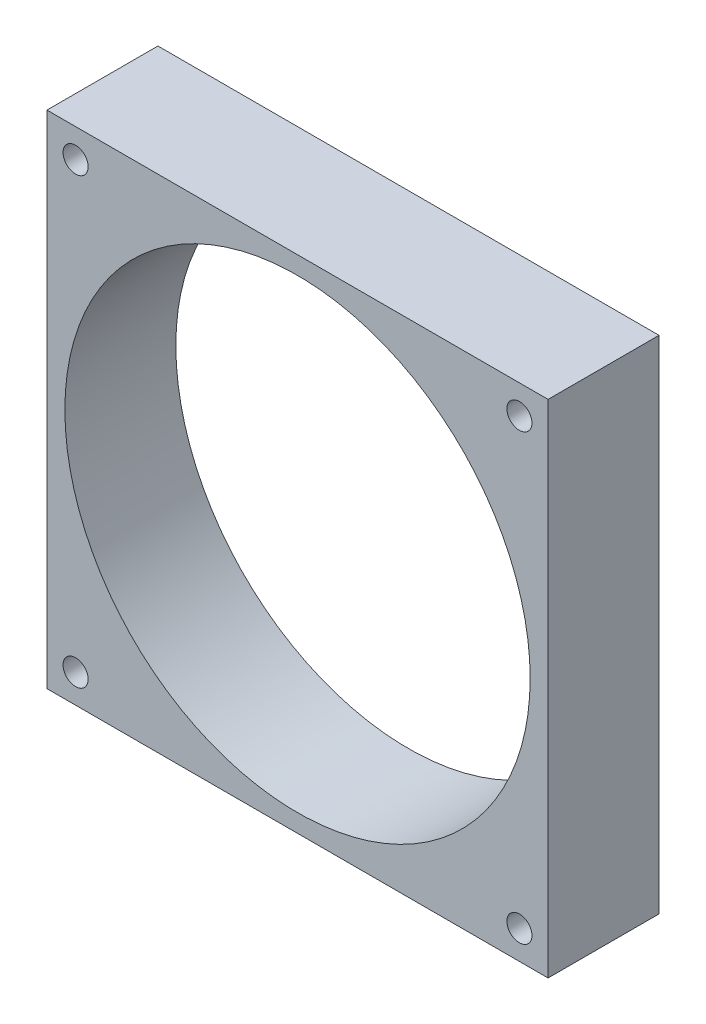
ISO-10303-21;
HEADER;
FILE_DESCRIPTION(('STEP AP214'),'2;1');
FILE_NAME('part.step','',(''),(''),'','','');
FILE_SCHEMA(('AUTOMOTIVE_DESIGN { 1 0 10303 214 1 1 1 1 }'));
ENDSEC;
DATA;
#1=APPLICATION_CONTEXT('core data for automotive mechanical design processes');
#2=APPLICATION_PROTOCOL_DEFINITION('international standard','automotive_design',2000,#1);
#3=PRODUCT_CONTEXT('',#1,'mechanical');
#4=PRODUCT('Part','Part','',(#3));
#5=PRODUCT_RELATED_PRODUCT_CATEGORY('part','',(#4));
#6=PRODUCT_DEFINITION_FORMATION('','',#4);
#7=PRODUCT_DEFINITION_CONTEXT('part definition',#1,'design');
#8=PRODUCT_DEFINITION('design','',#6,#7);
#9=PRODUCT_DEFINITION_SHAPE('','',#8);
#10=(LENGTH_UNIT() NAMED_UNIT(*) SI_UNIT(.MILLI.,.METRE.));
#11=(NAMED_UNIT(*) PLANE_ANGLE_UNIT() SI_UNIT($,.RADIAN.));
#12=(NAMED_UNIT(*) SI_UNIT($,.STERADIAN.) SOLID_ANGLE_UNIT());
#13=UNCERTAINTY_MEASURE_WITH_UNIT(LENGTH_MEASURE(1.E-05),#10,'distance_accuracy_value','');
#14=(GEOMETRIC_REPRESENTATION_CONTEXT(3) GLOBAL_UNCERTAINTY_ASSIGNED_CONTEXT((#13)) GLOBAL_UNIT_ASSIGNED_CONTEXT((#10,
#11,#12)) REPRESENTATION_CONTEXT('',''));
#15=CARTESIAN_POINT('',(0.,0.,0.));
#16=DIRECTION('',(0.,0.,1.));
#17=DIRECTION('',(1.,0.,0.));
#18=AXIS2_PLACEMENT_3D('',#15,#16,#17);
#19=CARTESIAN_POINT('',(35.,0.,15.5));
#20=DIRECTION('',(1.,0.,0.));
#21=DIRECTION('',(0.,1.,0.));
#22=AXIS2_PLACEMENT_3D('',#19,#20,#21);
#23=PLANE('',#22);
#24=DIRECTION('',(0.,-1.,0.));
#25=VECTOR('',#24,1.);
#26=CARTESIAN_POINT('',(35.,0.,0.));
#27=LINE('',#26,#25);
#28=CARTESIAN_POINT('',(35.,35.,0.));
#29=VERTEX_POINT('',#28);
#30=CARTESIAN_POINT('',(35.,-35.,0.));
#31=VERTEX_POINT('',#30);
#32=EDGE_CURVE('E117',#29,#31,#27,.T.);
#33=ORIENTED_EDGE('',*,*,#32,.F.);
#34=DIRECTION('',(0.,0.,-1.));
#35=VECTOR('',#34,1.);
#36=CARTESIAN_POINT('',(35.,35.,15.5));
#37=LINE('',#36,#35);
#38=CARTESIAN_POINT('',(35.,35.,15.5));
#39=VERTEX_POINT('',#38);
#40=EDGE_CURVE('E11',#39,#29,#37,.T.);
#41=ORIENTED_EDGE('',*,*,#40,.F.);
#42=DIRECTION('',(0.,-1.,0.));
#43=VECTOR('',#42,1.);
#44=CARTESIAN_POINT('',(35.,0.,15.5));
#45=LINE('',#44,#43);
#46=CARTESIAN_POINT('',(35.,-35.,15.5));
#47=VERTEX_POINT('',#46);
#48=EDGE_CURVE('E95',#39,#47,#45,.T.);
#49=ORIENTED_EDGE('',*,*,#48,.T.);
#50=DIRECTION('',(0.,0.,-1.));
#51=VECTOR('',#50,1.);
#52=CARTESIAN_POINT('',(35.,-35.,15.5));
#53=LINE('',#52,#51);
#54=EDGE_CURVE('E74',#47,#31,#53,.T.);
#55=ORIENTED_EDGE('',*,*,#54,.T.);
#56=EDGE_LOOP('',(#33,#41,#49,#55));
#57=FACE_BOUND('',#56,.T.);
#58=ADVANCED_FACE('F34',(#57),#23,.T.);
#59=CARTESIAN_POINT('',(0.,35.,15.5));
#60=DIRECTION('',(0.,1.,0.));
#61=DIRECTION('',(0.,0.,1.));
#62=AXIS2_PLACEMENT_3D('',#59,#60,#61);
#63=PLANE('',#62);
#64=DIRECTION('',(1.,0.,0.));
#65=VECTOR('',#64,1.);
#66=CARTESIAN_POINT('',(0.,35.,0.));
#67=LINE('',#66,#65);
#68=CARTESIAN_POINT('',(-35.,35.,0.));
#69=VERTEX_POINT('',#68);
#70=EDGE_CURVE('E86',#69,#29,#67,.T.);
#71=ORIENTED_EDGE('',*,*,#70,.F.);
#72=DIRECTION('',(0.,0.,-1.));
#73=VECTOR('',#72,1.);
#74=CARTESIAN_POINT('',(-35.,35.,15.5));
#75=LINE('',#74,#73);
#76=CARTESIAN_POINT('',(-35.,35.,15.5));
#77=VERTEX_POINT('',#76);
#78=EDGE_CURVE('E43',#77,#69,#75,.T.);
#79=ORIENTED_EDGE('',*,*,#78,.F.);
#80=DIRECTION('',(1.,0.,0.));
#81=VECTOR('',#80,1.);
#82=CARTESIAN_POINT('',(0.,35.,15.5));
#83=LINE('',#82,#81);
#84=EDGE_CURVE('E84',#77,#39,#83,.T.);
#85=ORIENTED_EDGE('',*,*,#84,.T.);
#86=ORIENTED_EDGE('',*,*,#40,.T.);
#87=EDGE_LOOP('',(#71,#79,#85,#86));
#88=FACE_BOUND('',#87,.T.);
#89=ADVANCED_FACE('F82',(#88),#63,.T.);
#90=CARTESIAN_POINT('',(-35.,0.,15.5));
#91=DIRECTION('',(1.,0.,0.));
#92=DIRECTION('',(0.,1.,0.));
#93=AXIS2_PLACEMENT_3D('',#90,#91,#92);
#94=PLANE('',#93);
#95=DIRECTION('',(0.,-1.,0.));
#96=VECTOR('',#95,1.);
#97=CARTESIAN_POINT('',(-35.,0.,0.));
#98=LINE('',#97,#96);
#99=CARTESIAN_POINT('',(-35.,-35.,0.));
#100=VERTEX_POINT('',#99);
#101=EDGE_CURVE('E120',#69,#100,#98,.T.);
#102=ORIENTED_EDGE('',*,*,#101,.T.);
#103=DIRECTION('',(0.,0.,-1.));
#104=VECTOR('',#103,1.);
#105=CARTESIAN_POINT('',(-35.,-35.,15.5));
#106=LINE('',#105,#104);
#107=CARTESIAN_POINT('',(-35.,-35.,15.5));
#108=VERTEX_POINT('',#107);
#109=EDGE_CURVE('E89',#108,#100,#106,.T.);
#110=ORIENTED_EDGE('',*,*,#109,.F.);
#111=DIRECTION('',(0.,-1.,0.));
#112=VECTOR('',#111,1.);
#113=CARTESIAN_POINT('',(-35.,0.,15.5));
#114=LINE('',#113,#112);
#115=EDGE_CURVE('E91',#77,#108,#114,.T.);
#116=ORIENTED_EDGE('',*,*,#115,.F.);
#117=ORIENTED_EDGE('',*,*,#78,.T.);
#118=EDGE_LOOP('',(#102,#110,#116,#117));
#119=FACE_BOUND('',#118,.T.);
#120=ADVANCED_FACE('F92',(#119),#94,.F.);
#121=CARTESIAN_POINT('',(-31.,31.,15.5));
#122=DIRECTION('',(0.,0.,-1.));
#123=DIRECTION('',(-1.,0.,0.));
#124=AXIS2_PLACEMENT_3D('',#121,#122,#123);
#125=CYLINDRICAL_SURFACE('',#124,1.75);
#126=CARTESIAN_POINT('',(-31.,31.,15.5));
#127=DIRECTION('',(0.,0.,1.));
#128=DIRECTION('',(1.,0.,0.));
#129=AXIS2_PLACEMENT_3D('',#126,#127,#128);
#130=CIRCLE('',#129,1.75);
#131=CARTESIAN_POINT('',(-29.25,31.,15.5));
#132=VERTEX_POINT('',#131);
#133=EDGE_CURVE('E97',#132,#132,#130,.T.);
#134=ORIENTED_EDGE('',*,*,#133,.T.);
#135=EDGE_LOOP('',(#134));
#136=FACE_BOUND('',#135,.T.);
#137=CARTESIAN_POINT('',(-31.,31.,0.));
#138=DIRECTION('',(0.,0.,1.));
#139=DIRECTION('',(1.,0.,0.));
#140=AXIS2_PLACEMENT_3D('',#137,#138,#139);
#141=CIRCLE('',#140,1.75);
#142=CARTESIAN_POINT('',(-29.25,31.,0.));
#143=VERTEX_POINT('',#142);
#144=EDGE_CURVE('E114',#143,#143,#141,.T.);
#145=ORIENTED_EDGE('',*,*,#144,.F.);
#146=EDGE_LOOP('',(#145));
#147=FACE_BOUND('',#146,.T.);
#148=ADVANCED_FACE('F136',(#136,#147),#125,.F.);
#149=CARTESIAN_POINT('',(0.,0.,15.5));
#150=DIRECTION('',(0.,0.,-1.));
#151=DIRECTION('',(-1.,0.,0.));
#152=AXIS2_PLACEMENT_3D('',#149,#150,#151);
#153=CYLINDRICAL_SURFACE('',#152,32.5);
#154=CARTESIAN_POINT('',(0.,0.,15.5));
#155=DIRECTION('',(0.,0.,1.));
#156=DIRECTION('',(1.,0.,0.));
#157=AXIS2_PLACEMENT_3D('',#154,#155,#156);
#158=CIRCLE('',#157,32.5);
#159=CARTESIAN_POINT('',(32.5,0.,15.5));
#160=VERTEX_POINT('',#159);
#161=EDGE_CURVE('E262',#160,#160,#158,.T.);
#162=ORIENTED_EDGE('',*,*,#161,.T.);
#163=EDGE_LOOP('',(#162));
#164=FACE_BOUND('',#163,.T.);
#165=CARTESIAN_POINT('',(0.,0.,0.));
#166=DIRECTION('',(0.,0.,1.));
#167=DIRECTION('',(1.,0.,0.));
#168=AXIS2_PLACEMENT_3D('',#165,#166,#167);
#169=CIRCLE('',#168,32.5);
#170=CARTESIAN_POINT('',(32.5,0.,0.));
#171=VERTEX_POINT('',#170);
#172=EDGE_CURVE('E111',#171,#171,#169,.T.);
#173=ORIENTED_EDGE('',*,*,#172,.F.);
#174=EDGE_LOOP('',(#173));
#175=FACE_BOUND('',#174,.T.);
#176=ADVANCED_FACE('F139',(#164,#175),#153,.F.);
#177=CARTESIAN_POINT('',(31.0000000000001,30.9999999999999,15.5));
#178=DIRECTION('',(0.,0.,-1.));
#179=DIRECTION('',(-1.,0.,0.));
#180=AXIS2_PLACEMENT_3D('',#177,#178,#179);
#181=CYLINDRICAL_SURFACE('',#180,1.75);
#182=CARTESIAN_POINT('',(31.0000000000001,30.9999999999999,15.5));
#183=DIRECTION('',(0.,0.,1.));
#184=DIRECTION('',(1.,0.,0.));
#185=AXIS2_PLACEMENT_3D('',#182,#183,#184);
#186=CIRCLE('',#185,1.75);
#187=CARTESIAN_POINT('',(32.7500000000001,30.9999999999999,15.5));
#188=VERTEX_POINT('',#187);
#189=EDGE_CURVE('E258',#188,#188,#186,.T.);
#190=ORIENTED_EDGE('',*,*,#189,.T.);
#191=EDGE_LOOP('',(#190));
#192=FACE_BOUND('',#191,.T.);
#193=CARTESIAN_POINT('',(31.0000000000001,30.9999999999999,0.));
#194=DIRECTION('',(0.,0.,1.));
#195=DIRECTION('',(1.,0.,0.));
#196=AXIS2_PLACEMENT_3D('',#193,#194,#195);
#197=CIRCLE('',#196,1.75);
#198=CARTESIAN_POINT('',(32.7500000000001,30.9999999999999,0.));
#199=VERTEX_POINT('',#198);
#200=EDGE_CURVE('E108',#199,#199,#197,.T.);
#201=ORIENTED_EDGE('',*,*,#200,.F.);
#202=EDGE_LOOP('',(#201));
#203=FACE_BOUND('',#202,.T.);
#204=ADVANCED_FACE('F143',(#192,#203),#181,.F.);
#205=CARTESIAN_POINT('',(30.9999999999998,-31.0000000000002,15.5));
#206=DIRECTION('',(0.,0.,-1.));
#207=DIRECTION('',(-1.,0.,0.));
#208=AXIS2_PLACEMENT_3D('',#205,#206,#207);
#209=CYLINDRICAL_SURFACE('',#208,1.75);
#210=CARTESIAN_POINT('',(30.9999999999998,-31.0000000000002,15.5));
#211=DIRECTION('',(0.,0.,1.));
#212=DIRECTION('',(1.,0.,0.));
#213=AXIS2_PLACEMENT_3D('',#210,#211,#212);
#214=CIRCLE('',#213,1.75);
#215=CARTESIAN_POINT('',(32.7499999999998,-31.0000000000002,15.5));
#216=VERTEX_POINT('',#215);
#217=EDGE_CURVE('E157',#216,#216,#214,.T.);
#218=ORIENTED_EDGE('',*,*,#217,.T.);
#219=EDGE_LOOP('',(#218));
#220=FACE_BOUND('',#219,.T.);
#221=CARTESIAN_POINT('',(30.9999999999998,-31.0000000000002,0.));
#222=DIRECTION('',(0.,0.,1.));
#223=DIRECTION('',(1.,0.,0.));
#224=AXIS2_PLACEMENT_3D('',#221,#222,#223);
#225=CIRCLE('',#224,1.75);
#226=CARTESIAN_POINT('',(32.7499999999998,-31.0000000000002,0.));
#227=VERTEX_POINT('',#226);
#228=EDGE_CURVE('E105',#227,#227,#225,.T.);
#229=ORIENTED_EDGE('',*,*,#228,.F.);
#230=EDGE_LOOP('',(#229));
#231=FACE_BOUND('',#230,.T.);
#232=ADVANCED_FACE('F146',(#220,#231),#209,.F.);
#233=CARTESIAN_POINT('',(-31.0000000000003,-30.9999999999997,15.5));
#234=DIRECTION('',(0.,0.,-1.));
#235=DIRECTION('',(-1.,0.,0.));
#236=AXIS2_PLACEMENT_3D('',#233,#234,#235);
#237=CYLINDRICAL_SURFACE('',#236,1.75);
#238=CARTESIAN_POINT('',(-31.0000000000003,-30.9999999999997,15.5));
#239=DIRECTION('',(0.,0.,1.));
#240=DIRECTION('',(1.,0.,0.));
#241=AXIS2_PLACEMENT_3D('',#238,#239,#240);
#242=CIRCLE('',#241,1.75);
#243=CARTESIAN_POINT('',(-29.2500000000003,-30.9999999999997,15.5));
#244=VERTEX_POINT('',#243);
#245=EDGE_CURVE('E123',#244,#244,#242,.T.);
#246=ORIENTED_EDGE('',*,*,#245,.T.);
#247=EDGE_LOOP('',(#246));
#248=FACE_BOUND('',#247,.T.);
#249=CARTESIAN_POINT('',(-31.0000000000003,-30.9999999999997,0.));
#250=DIRECTION('',(0.,0.,1.));
#251=DIRECTION('',(1.,0.,0.));
#252=AXIS2_PLACEMENT_3D('',#249,#250,#251);
#253=CIRCLE('',#252,1.75);
#254=CARTESIAN_POINT('',(-29.2500000000003,-30.9999999999997,0.));
#255=VERTEX_POINT('',#254);
#256=EDGE_CURVE('E102',#255,#255,#253,.T.);
#257=ORIENTED_EDGE('',*,*,#256,.F.);
#258=EDGE_LOOP('',(#257));
#259=FACE_BOUND('',#258,.T.);
#260=ADVANCED_FACE('F36',(#248,#259),#237,.F.);
#261=CARTESIAN_POINT('',(0.,-35.,15.5));
#262=DIRECTION('',(0.,1.,0.));
#263=DIRECTION('',(0.,0.,1.));
#264=AXIS2_PLACEMENT_3D('',#261,#262,#263);
#265=PLANE('',#264);
#266=DIRECTION('',(1.,0.,0.));
#267=VECTOR('',#266,1.);
#268=CARTESIAN_POINT('',(0.,-35.,0.));
#269=LINE('',#268,#267);
#270=EDGE_CURVE('E67',#100,#31,#269,.T.);
#271=ORIENTED_EDGE('',*,*,#270,.T.);
#272=ORIENTED_EDGE('',*,*,#54,.F.);
#273=DIRECTION('',(1.,0.,0.));
#274=VECTOR('',#273,1.);
#275=CARTESIAN_POINT('',(0.,-35.,15.5));
#276=LINE('',#275,#274);
#277=EDGE_CURVE('E51',#108,#47,#276,.T.);
#278=ORIENTED_EDGE('',*,*,#277,.F.);
#279=ORIENTED_EDGE('',*,*,#109,.T.);
#280=EDGE_LOOP('',(#271,#272,#278,#279));
#281=FACE_BOUND('',#280,.T.);
#282=ADVANCED_FACE('F126',(#281),#265,.F.);
#283=CARTESIAN_POINT('',(0.,0.,15.5));
#284=DIRECTION('',(0.,0.,1.));
#285=DIRECTION('',(1.,0.,0.));
#286=AXIS2_PLACEMENT_3D('',#283,#284,#285);
#287=PLANE('',#286);
#288=ORIENTED_EDGE('',*,*,#245,.F.);
#289=EDGE_LOOP('',(#288));
#290=FACE_BOUND('',#289,.T.);
#291=ORIENTED_EDGE('',*,*,#217,.F.);
#292=EDGE_LOOP('',(#291));
#293=FACE_BOUND('',#292,.T.);
#294=ORIENTED_EDGE('',*,*,#189,.F.);
#295=EDGE_LOOP('',(#294));
#296=FACE_BOUND('',#295,.T.);
#297=ORIENTED_EDGE('',*,*,#161,.F.);
#298=EDGE_LOOP('',(#297));
#299=FACE_BOUND('',#298,.T.);
#300=ORIENTED_EDGE('',*,*,#133,.F.);
#301=EDGE_LOOP('',(#300));
#302=FACE_BOUND('',#301,.T.);
#303=ORIENTED_EDGE('',*,*,#48,.F.);
#304=ORIENTED_EDGE('',*,*,#84,.F.);
#305=ORIENTED_EDGE('',*,*,#115,.T.);
#306=ORIENTED_EDGE('',*,*,#277,.T.);
#307=EDGE_LOOP('',(#303,#304,#305,#306));
#308=FACE_BOUND('',#307,.T.);
#309=ADVANCED_FACE('F94',(#290,#293,#296,#299,#302,#308),#287,.T.);
#310=CARTESIAN_POINT('',(0.,0.,0.));
#311=DIRECTION('',(0.,0.,1.));
#312=DIRECTION('',(1.,0.,0.));
#313=AXIS2_PLACEMENT_3D('',#310,#311,#312);
#314=PLANE('',#313);
#315=ORIENTED_EDGE('',*,*,#256,.T.);
#316=EDGE_LOOP('',(#315));
#317=FACE_BOUND('',#316,.T.);
#318=ORIENTED_EDGE('',*,*,#228,.T.);
#319=EDGE_LOOP('',(#318));
#320=FACE_BOUND('',#319,.T.);
#321=ORIENTED_EDGE('',*,*,#200,.T.);
#322=EDGE_LOOP('',(#321));
#323=FACE_BOUND('',#322,.T.);
#324=ORIENTED_EDGE('',*,*,#172,.T.);
#325=EDGE_LOOP('',(#324));
#326=FACE_BOUND('',#325,.T.);
#327=ORIENTED_EDGE('',*,*,#144,.T.);
#328=EDGE_LOOP('',(#327));
#329=FACE_BOUND('',#328,.T.);
#330=ORIENTED_EDGE('',*,*,#32,.T.);
#331=ORIENTED_EDGE('',*,*,#270,.F.);
#332=ORIENTED_EDGE('',*,*,#101,.F.);
#333=ORIENTED_EDGE('',*,*,#70,.T.);
#334=EDGE_LOOP('',(#330,#331,#332,#333));
#335=FACE_BOUND('',#334,.T.);
#336=ADVANCED_FACE('F127',(#317,#320,#323,#326,#329,#335),#314,.F.);
#337=CLOSED_SHELL('',(#58,#89,#120,#148,#176,#204,#232,#260,#282,#309,#336));
#338=MANIFOLD_SOLID_BREP('B2',#337);
#339=ADVANCED_BREP_SHAPE_REPRESENTATION('',(#18,#338),#14);
#340=SHAPE_DEFINITION_REPRESENTATION(#9,#339);
ENDSEC;
END-ISO-10303-21;
